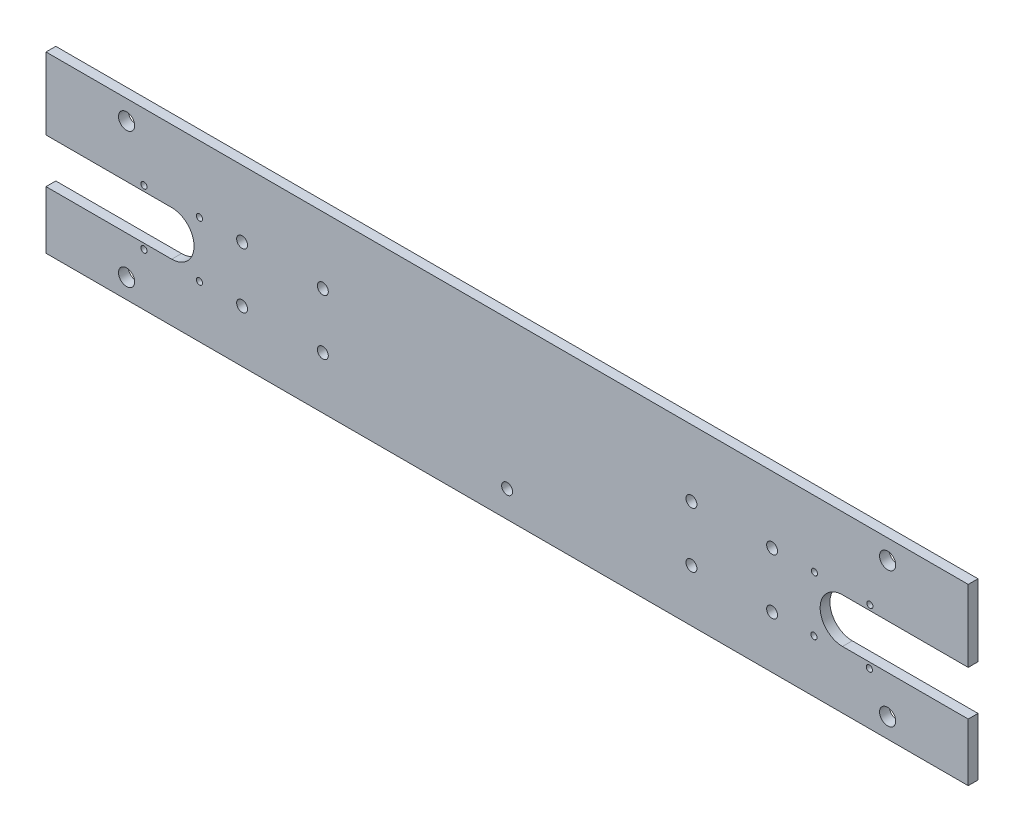
ISO-10303-21;
HEADER;
FILE_DESCRIPTION(('STEP AP214'),'2;1');
FILE_NAME('part.step','',(''),(''),'','','');
FILE_SCHEMA(('AUTOMOTIVE_DESIGN { 1 0 10303 214 1 1 1 1 }'));
ENDSEC;
DATA;
#1=APPLICATION_CONTEXT('core data for automotive mechanical design processes');
#2=APPLICATION_PROTOCOL_DEFINITION('international standard','automotive_design',2000,#1);
#3=PRODUCT_CONTEXT('',#1,'mechanical');
#4=PRODUCT('Part','Part','',(#3));
#5=PRODUCT_RELATED_PRODUCT_CATEGORY('part','',(#4));
#6=PRODUCT_DEFINITION_FORMATION('','',#4);
#7=PRODUCT_DEFINITION_CONTEXT('part definition',#1,'design');
#8=PRODUCT_DEFINITION('design','',#6,#7);
#9=PRODUCT_DEFINITION_SHAPE('','',#8);
#10=(LENGTH_UNIT() NAMED_UNIT(*) SI_UNIT(.MILLI.,.METRE.));
#11=(NAMED_UNIT(*) PLANE_ANGLE_UNIT() SI_UNIT($,.RADIAN.));
#12=(NAMED_UNIT(*) SI_UNIT($,.STERADIAN.) SOLID_ANGLE_UNIT());
#13=UNCERTAINTY_MEASURE_WITH_UNIT(LENGTH_MEASURE(1.E-05),#10,'distance_accuracy_value','');
#14=(GEOMETRIC_REPRESENTATION_CONTEXT(3) GLOBAL_UNCERTAINTY_ASSIGNED_CONTEXT((#13)) GLOBAL_UNIT_ASSIGNED_CONTEXT((#10,
#11,#12)) REPRESENTATION_CONTEXT('',''));
#15=CARTESIAN_POINT('',(0.,0.,0.));
#16=DIRECTION('',(0.,0.,1.));
#17=DIRECTION('',(1.,0.,0.));
#18=AXIS2_PLACEMENT_3D('',#15,#16,#17);
#19=CARTESIAN_POINT('',(13.0279414326682,139.511167818449,3.175));
#20=DIRECTION('',(1.,0.,0.));
#21=DIRECTION('',(0.,0.,-1.));
#22=AXIS2_PLACEMENT_3D('',#19,#20,#21);
#23=PLANE('',#22);
#24=DIRECTION('',(0.,-1.,0.));
#25=VECTOR('',#24,1.);
#26=CARTESIAN_POINT('',(13.0279414326682,139.511167818449,3.175));
#27=LINE('',#26,#25);
#28=CARTESIAN_POINT('',(13.0279414326682,101.654807818093,3.175));
#29=VERTEX_POINT('',#28);
#30=CARTESIAN_POINT('',(13.0279414326682,82.9123478184496,3.175));
#31=VERTEX_POINT('',#30);
#32=EDGE_CURVE('E319',#29,#31,#27,.T.);
#33=ORIENTED_EDGE('',*,*,#32,.F.);
#34=DIRECTION('',(0.,0.,1.));
#35=VECTOR('',#34,1.);
#36=CARTESIAN_POINT('',(13.0279414326682,101.654807818093,0.));
#37=LINE('',#36,#35);
#38=CARTESIAN_POINT('',(13.0279414326682,101.654807818093,0.));
#39=VERTEX_POINT('',#38);
#40=EDGE_CURVE('E163',#39,#29,#37,.T.);
#41=ORIENTED_EDGE('',*,*,#40,.F.);
#42=DIRECTION('',(0.,-1.,0.));
#43=VECTOR('',#42,1.);
#44=CARTESIAN_POINT('',(13.0279414326682,139.511167818449,0.));
#45=LINE('',#44,#43);
#46=CARTESIAN_POINT('',(13.0279414326682,82.9123478184496,0.));
#47=VERTEX_POINT('',#46);
#48=EDGE_CURVE('E312',#39,#47,#45,.T.);
#49=ORIENTED_EDGE('',*,*,#48,.T.);
#50=DIRECTION('',(0.,0.,-1.));
#51=VECTOR('',#50,1.);
#52=CARTESIAN_POINT('',(13.0279414326682,82.9123478184496,3.175));
#53=LINE('',#52,#51);
#54=EDGE_CURVE('E11',#31,#47,#53,.T.);
#55=ORIENTED_EDGE('',*,*,#54,.F.);
#56=EDGE_LOOP('',(#33,#41,#49,#55));
#57=FACE_BOUND('',#56,.T.);
#58=ADVANCED_FACE('F41',(#57),#23,.F.);
#59=CARTESIAN_POINT('',(312.426067450613,139.511167818449,3.175));
#60=DIRECTION('',(-1.,0.,0.));
#61=DIRECTION('',(0.,0.,1.));
#62=AXIS2_PLACEMENT_3D('',#59,#60,#61);
#63=PLANE('',#62);
#64=DIRECTION('',(0.,1.,0.));
#65=VECTOR('',#64,1.);
#66=CARTESIAN_POINT('',(312.426067450613,139.511167818449,3.175));
#67=LINE('',#66,#65);
#68=CARTESIAN_POINT('',(312.426067450613,116.163287818093,3.175));
#69=VERTEX_POINT('',#68);
#70=CARTESIAN_POINT('',(312.426067450613,139.511167818449,3.175));
#71=VERTEX_POINT('',#70);
#72=EDGE_CURVE('E321',#69,#71,#67,.T.);
#73=ORIENTED_EDGE('',*,*,#72,.F.);
#74=DIRECTION('',(0.,0.,1.));
#75=VECTOR('',#74,1.);
#76=CARTESIAN_POINT('',(312.426067450613,116.163287818093,0.));
#77=LINE('',#76,#75);
#78=CARTESIAN_POINT('',(312.426067450613,116.163287818093,0.));
#79=VERTEX_POINT('',#78);
#80=EDGE_CURVE('E184',#79,#69,#77,.T.);
#81=ORIENTED_EDGE('',*,*,#80,.F.);
#82=DIRECTION('',(0.,1.,0.));
#83=VECTOR('',#82,1.);
#84=CARTESIAN_POINT('',(312.426067450613,139.511167818449,0.));
#85=LINE('',#84,#83);
#86=CARTESIAN_POINT('',(312.426067450613,139.511167818449,0.));
#87=VERTEX_POINT('',#86);
#88=EDGE_CURVE('E332',#79,#87,#85,.T.);
#89=ORIENTED_EDGE('',*,*,#88,.T.);
#90=DIRECTION('',(0.,0.,-1.));
#91=VECTOR('',#90,1.);
#92=CARTESIAN_POINT('',(312.426067450613,139.511167818449,3.175));
#93=LINE('',#92,#91);
#94=EDGE_CURVE('E340',#71,#87,#93,.T.);
#95=ORIENTED_EDGE('',*,*,#94,.F.);
#96=EDGE_LOOP('',(#73,#81,#89,#95));
#97=FACE_BOUND('',#96,.T.);
#98=ADVANCED_FACE('F377',(#97),#63,.F.);
#99=CARTESIAN_POINT('',(0.,0.,3.175));
#100=DIRECTION('',(0.,0.,1.));
#101=DIRECTION('',(1.,0.,0.));
#102=AXIS2_PLACEMENT_3D('',#99,#100,#101);
#103=PLANE('',#102);
#104=DIRECTION('',(1.,0.,0.));
#105=VECTOR('',#104,1.);
#106=CARTESIAN_POINT('',(53.8457414326691,101.654807818093,3.175));
#107=LINE('',#106,#105);
#108=CARTESIAN_POINT('',(53.8457414326691,101.654807818093,3.175));
#109=VERTEX_POINT('',#108);
#110=EDGE_CURVE('E151',#29,#109,#107,.T.);
#111=ORIENTED_EDGE('',*,*,#110,.F.);
#112=ORIENTED_EDGE('',*,*,#32,.T.);
#113=DIRECTION('',(1.,0.,0.));
#114=VECTOR('',#113,1.);
#115=CARTESIAN_POINT('',(13.0279414326682,82.9123478184496,3.175));
#116=LINE('',#115,#114);
#117=CARTESIAN_POINT('',(312.426067450613,82.9123478184496,3.175));
#118=VERTEX_POINT('',#117);
#119=EDGE_CURVE('E318',#31,#118,#116,.T.);
#120=ORIENTED_EDGE('',*,*,#119,.T.);
#121=CARTESIAN_POINT('',(312.426067450613,101.654807818093,3.175));
#122=VERTEX_POINT('',#121);
#123=EDGE_CURVE('E322',#118,#122,#67,.T.);
#124=ORIENTED_EDGE('',*,*,#123,.T.);
#125=DIRECTION('',(1.,0.,0.));
#126=VECTOR('',#125,1.);
#127=CARTESIAN_POINT('',(271.608267450612,101.654807818093,3.175));
#128=LINE('',#127,#126);
#129=CARTESIAN_POINT('',(271.608267450612,101.654807818093,3.175));
#130=VERTEX_POINT('',#129);
#131=EDGE_CURVE('E64',#130,#122,#128,.T.);
#132=ORIENTED_EDGE('',*,*,#131,.F.);
#133=CARTESIAN_POINT('',(271.608267450612,108.909047818093,3.175));
#134=DIRECTION('',(0.,0.,1.));
#135=DIRECTION('',(-1.,0.,0.));
#136=AXIS2_PLACEMENT_3D('',#133,#134,#135);
#137=CIRCLE('',#136,7.25423999999999);
#138=CARTESIAN_POINT('',(271.608267450612,116.163287818093,3.175));
#139=VERTEX_POINT('',#138);
#140=EDGE_CURVE('E177',#139,#130,#137,.T.);
#141=ORIENTED_EDGE('',*,*,#140,.F.);
#142=DIRECTION('',(-1.,0.,0.));
#143=VECTOR('',#142,1.);
#144=CARTESIAN_POINT('',(271.608267450612,116.163287818093,3.175));
#145=LINE('',#144,#143);
#146=EDGE_CURVE('E170',#69,#139,#145,.T.);
#147=ORIENTED_EDGE('',*,*,#146,.F.);
#148=ORIENTED_EDGE('',*,*,#72,.T.);
#149=DIRECTION('',(-1.,0.,0.));
#150=VECTOR('',#149,1.);
#151=CARTESIAN_POINT('',(13.0279414326682,139.511167818449,3.175));
#152=LINE('',#151,#150);
#153=CARTESIAN_POINT('',(13.0279414326682,139.511167818449,3.175));
#154=VERTEX_POINT('',#153);
#155=EDGE_CURVE('E325',#71,#154,#152,.T.);
#156=ORIENTED_EDGE('',*,*,#155,.T.);
#157=CARTESIAN_POINT('',(13.0279414326682,116.163287818093,3.175));
#158=VERTEX_POINT('',#157);
#159=EDGE_CURVE('E315',#154,#158,#27,.T.);
#160=ORIENTED_EDGE('',*,*,#159,.T.);
#161=DIRECTION('',(-1.,0.,0.));
#162=VECTOR('',#161,1.);
#163=CARTESIAN_POINT('',(53.8457414326691,116.163287818093,3.175));
#164=LINE('',#163,#162);
#165=CARTESIAN_POINT('',(53.8457414326691,116.163287818093,3.175));
#166=VERTEX_POINT('',#165);
#167=EDGE_CURVE('E56',#166,#158,#164,.T.);
#168=ORIENTED_EDGE('',*,*,#167,.F.);
#169=CARTESIAN_POINT('',(53.8457414326691,108.909047818093,3.175));
#170=DIRECTION('',(0.,0.,1.));
#171=DIRECTION('',(1.,0.,0.));
#172=AXIS2_PLACEMENT_3D('',#169,#170,#171);
#173=CIRCLE('',#172,7.25423999999999);
#174=EDGE_CURVE('E137',#109,#166,#173,.T.);
#175=ORIENTED_EDGE('',*,*,#174,.F.);
#176=EDGE_LOOP('',(#111,#112,#120,#124,#132,#141,#147,#148,#156,#160,#168,#175));
#177=FACE_BOUND('',#176,.T.);
#178=CARTESIAN_POINT('',(248.758451386409,99.9090478180932,3.175));
#179=DIRECTION('',(0.,0.,1.));
#180=DIRECTION('',(-1.,0.,0.));
#181=AXIS2_PLACEMENT_3D('',#178,#179,#180);
#182=CIRCLE('',#181,1.77799999999998);
#183=CARTESIAN_POINT('',(246.980451386409,99.9090478180932,3.175));
#184=VERTEX_POINT('',#183);
#185=EDGE_CURVE('E204',#184,#184,#182,.T.);
#186=ORIENTED_EDGE('',*,*,#185,.F.);
#187=EDGE_LOOP('',(#186));
#188=FACE_BOUND('',#187,.T.);
#189=CARTESIAN_POINT('',(102.895189625278,99.9090478180938,3.175));
#190=DIRECTION('',(0.,0.,1.));
#191=DIRECTION('',(1.,0.,0.));
#192=AXIS2_PLACEMENT_3D('',#189,#190,#191);
#193=CIRCLE('',#192,1.778);
#194=CARTESIAN_POINT('',(104.673189625278,99.9090478180938,3.175));
#195=VERTEX_POINT('',#194);
#196=EDGE_CURVE('E217',#195,#195,#193,.T.);
#197=ORIENTED_EDGE('',*,*,#196,.F.);
#198=EDGE_LOOP('',(#197));
#199=FACE_BOUND('',#198,.T.);
#200=CARTESIAN_POINT('',(102.895189625278,117.909047818093,3.175));
#201=DIRECTION('',(0.,0.,1.));
#202=DIRECTION('',(1.,0.,0.));
#203=AXIS2_PLACEMENT_3D('',#200,#201,#202);
#204=CIRCLE('',#203,1.778);
#205=CARTESIAN_POINT('',(104.673189625278,117.909047818093,3.175));
#206=VERTEX_POINT('',#205);
#207=EDGE_CURVE('E216',#206,#206,#204,.T.);
#208=ORIENTED_EDGE('',*,*,#207,.F.);
#209=EDGE_LOOP('',(#208));
#210=FACE_BOUND('',#209,.T.);
#211=CARTESIAN_POINT('',(76.6955574968718,99.9090478180938,3.175));
#212=DIRECTION('',(0.,0.,1.));
#213=DIRECTION('',(1.,0.,0.));
#214=AXIS2_PLACEMENT_3D('',#211,#212,#213);
#215=CIRCLE('',#214,1.778);
#216=CARTESIAN_POINT('',(78.4735574968718,99.9090478180938,3.175));
#217=VERTEX_POINT('',#216);
#218=EDGE_CURVE('E229',#217,#217,#215,.T.);
#219=ORIENTED_EDGE('',*,*,#218,.F.);
#220=EDGE_LOOP('',(#219));
#221=FACE_BOUND('',#220,.T.);
#222=CARTESIAN_POINT('',(162.727004441641,91.5637545544701,3.175));
#223=DIRECTION('',(0.,0.,1.));
#224=DIRECTION('',(-1.,0.,0.));
#225=AXIS2_PLACEMENT_3D('',#222,#223,#224);
#226=CIRCLE('',#225,1.778);
#227=CARTESIAN_POINT('',(160.949004441641,91.5637545544701,3.175));
#228=VERTEX_POINT('',#227);
#229=EDGE_CURVE('E162',#228,#228,#226,.T.);
#230=ORIENTED_EDGE('',*,*,#229,.F.);
#231=EDGE_LOOP('',(#230));
#232=FACE_BOUND('',#231,.T.);
#233=CARTESIAN_POINT('',(248.758451386409,117.909047818092,3.175));
#234=DIRECTION('',(0.,0.,1.));
#235=DIRECTION('',(-1.,0.,0.));
#236=AXIS2_PLACEMENT_3D('',#233,#234,#235);
#237=CIRCLE('',#236,1.77799999999995);
#238=CARTESIAN_POINT('',(246.980451386409,117.909047818092,3.175));
#239=VERTEX_POINT('',#238);
#240=EDGE_CURVE('E193',#239,#239,#237,.T.);
#241=ORIENTED_EDGE('',*,*,#240,.F.);
#242=EDGE_LOOP('',(#241));
#243=FACE_BOUND('',#242,.T.);
#244=CARTESIAN_POINT('',(222.558819258003,117.909047818093,3.175));
#245=DIRECTION('',(0.,0.,1.));
#246=DIRECTION('',(-1.,0.,0.));
#247=AXIS2_PLACEMENT_3D('',#244,#245,#246);
#248=CIRCLE('',#247,1.778);
#249=CARTESIAN_POINT('',(220.780819258003,117.909047818093,3.175));
#250=VERTEX_POINT('',#249);
#251=EDGE_CURVE('E192',#250,#250,#248,.T.);
#252=ORIENTED_EDGE('',*,*,#251,.F.);
#253=EDGE_LOOP('',(#252));
#254=FACE_BOUND('',#253,.T.);
#255=CARTESIAN_POINT('',(222.558819258003,99.9090478180934,3.175));
#256=DIRECTION('',(0.,0.,1.));
#257=DIRECTION('',(-1.,0.,0.));
#258=AXIS2_PLACEMENT_3D('',#255,#256,#257);
#259=CIRCLE('',#258,1.778);
#260=CARTESIAN_POINT('',(220.780819258003,99.9090478180934,3.175));
#261=VERTEX_POINT('',#260);
#262=EDGE_CURVE('E205',#261,#261,#259,.T.);
#263=ORIENTED_EDGE('',*,*,#262,.F.);
#264=EDGE_LOOP('',(#263));
#265=FACE_BOUND('',#264,.T.);
#266=CARTESIAN_POINT('',(76.6955574968717,117.909047818093,3.175));
#267=DIRECTION('',(0.,0.,1.));
#268=DIRECTION('',(1.,0.,0.));
#269=AXIS2_PLACEMENT_3D('',#266,#267,#268);
#270=CIRCLE('',#269,1.778);
#271=CARTESIAN_POINT('',(78.4735574968717,117.909047818093,3.175));
#272=VERTEX_POINT('',#271);
#273=EDGE_CURVE('E228',#272,#272,#270,.T.);
#274=ORIENTED_EDGE('',*,*,#273,.F.);
#275=EDGE_LOOP('',(#274));
#276=FACE_BOUND('',#275,.T.);
#277=CARTESIAN_POINT('',(62.8457414326686,117.909047818093,3.175));
#278=DIRECTION('',(0.,0.,1.));
#279=DIRECTION('',(1.,0.,0.));
#280=AXIS2_PLACEMENT_3D('',#277,#278,#279);
#281=CIRCLE('',#280,0.999999999999985);
#282=CARTESIAN_POINT('',(63.8457414326686,117.909047818093,3.175));
#283=VERTEX_POINT('',#282);
#284=EDGE_CURVE('E252',#283,#283,#281,.T.);
#285=ORIENTED_EDGE('',*,*,#284,.F.);
#286=EDGE_LOOP('',(#285));
#287=FACE_BOUND('',#286,.T.);
#288=CARTESIAN_POINT('',(262.336126105717,99.9939547590878,3.175));
#289=DIRECTION('',(0.,0.,1.));
#290=DIRECTION('',(1.,0.,0.));
#291=AXIS2_PLACEMENT_3D('',#288,#289,#290);
#292=CIRCLE('',#291,0.999999999999998);
#293=CARTESIAN_POINT('',(263.336126105717,99.9939547590878,3.175));
#294=VERTEX_POINT('',#293);
#295=EDGE_CURVE('E265',#294,#294,#292,.T.);
#296=ORIENTED_EDGE('',*,*,#295,.F.);
#297=EDGE_LOOP('',(#296));
#298=FACE_BOUND('',#297,.T.);
#299=CARTESIAN_POINT('',(262.504948479307,117.993163047403,3.175));
#300=DIRECTION('',(0.,0.,1.));
#301=DIRECTION('',(1.,0.,0.));
#302=AXIS2_PLACEMENT_3D('',#299,#300,#301);
#303=CIRCLE('',#302,0.999999999999998);
#304=CARTESIAN_POINT('',(263.504948479307,117.993163047403,3.175));
#305=VERTEX_POINT('',#304);
#306=EDGE_CURVE('E264',#305,#305,#303,.T.);
#307=ORIENTED_EDGE('',*,*,#306,.F.);
#308=EDGE_LOOP('',(#307));
#309=FACE_BOUND('',#308,.T.);
#310=CARTESIAN_POINT('',(280.335334394032,99.825132385498,3.175));
#311=DIRECTION('',(0.,0.,1.));
#312=DIRECTION('',(1.,0.,0.));
#313=AXIS2_PLACEMENT_3D('',#310,#311,#312);
#314=CIRCLE('',#313,0.999999999999998);
#315=CARTESIAN_POINT('',(281.335334394032,99.825132385498,3.175));
#316=VERTEX_POINT('',#315);
#317=EDGE_CURVE('E277',#316,#316,#314,.T.);
#318=ORIENTED_EDGE('',*,*,#317,.F.);
#319=EDGE_LOOP('',(#318));
#320=FACE_BOUND('',#319,.T.);
#321=CARTESIAN_POINT('',(44.8457414326697,99.9090478180936,3.175));
#322=DIRECTION('',(0.,0.,1.));
#323=DIRECTION('',(1.,0.,0.));
#324=AXIS2_PLACEMENT_3D('',#321,#322,#323);
#325=CIRCLE('',#324,0.999999999999985);
#326=CARTESIAN_POINT('',(45.8457414326696,99.9090478180936,3.175));
#327=VERTEX_POINT('',#326);
#328=EDGE_CURVE('E240',#327,#327,#325,.T.);
#329=ORIENTED_EDGE('',*,*,#328,.F.);
#330=EDGE_LOOP('',(#329));
#331=FACE_BOUND('',#330,.T.);
#332=CARTESIAN_POINT('',(44.8457414326695,117.909047818093,3.175));
#333=DIRECTION('',(0.,0.,1.));
#334=DIRECTION('',(1.,0.,0.));
#335=AXIS2_PLACEMENT_3D('',#332,#333,#334);
#336=CIRCLE('',#335,0.999999999999985);
#337=CARTESIAN_POINT('',(45.8457414326694,117.909047818093,3.175));
#338=VERTEX_POINT('',#337);
#339=EDGE_CURVE('E246',#338,#338,#336,.T.);
#340=ORIENTED_EDGE('',*,*,#339,.F.);
#341=EDGE_LOOP('',(#340));
#342=FACE_BOUND('',#341,.T.);
#343=CARTESIAN_POINT('',(62.8457414326688,99.9090478180938,3.175));
#344=DIRECTION('',(0.,0.,1.));
#345=DIRECTION('',(1.,0.,0.));
#346=AXIS2_PLACEMENT_3D('',#343,#344,#345);
#347=CIRCLE('',#346,0.999999999999985);
#348=CARTESIAN_POINT('',(63.8457414326688,99.9090478180938,3.175));
#349=VERTEX_POINT('',#348);
#350=EDGE_CURVE('E253',#349,#349,#347,.T.);
#351=ORIENTED_EDGE('',*,*,#350,.F.);
#352=EDGE_LOOP('',(#351));
#353=FACE_BOUND('',#352,.T.);
#354=CARTESIAN_POINT('',(280.504156767622,117.824340673813,3.175));
#355=DIRECTION('',(0.,0.,1.));
#356=DIRECTION('',(1.,0.,0.));
#357=AXIS2_PLACEMENT_3D('',#354,#355,#356);
#358=CIRCLE('',#357,0.999999999999998);
#359=CARTESIAN_POINT('',(281.504156767622,117.824340673813,3.175));
#360=VERTEX_POINT('',#359);
#361=EDGE_CURVE('E276',#360,#360,#358,.T.);
#362=ORIENTED_EDGE('',*,*,#361,.F.);
#363=EDGE_LOOP('',(#362));
#364=FACE_BOUND('',#363,.T.);
#365=CARTESIAN_POINT('',(39.1874014326683,133.161167818449,3.175));
#366=DIRECTION('',(0.,0.,1.));
#367=DIRECTION('',(1.,0.,0.));
#368=AXIS2_PLACEMENT_3D('',#365,#366,#367);
#369=CIRCLE('',#368,2.62500000000002);
#370=CARTESIAN_POINT('',(41.8124014326683,133.161167818449,3.175));
#371=VERTEX_POINT('',#370);
#372=EDGE_CURVE('E297',#371,#371,#369,.T.);
#373=ORIENTED_EDGE('',*,*,#372,.F.);
#374=EDGE_LOOP('',(#373));
#375=FACE_BOUND('',#374,.T.);
#376=CARTESIAN_POINT('',(286.266607450613,133.16116781845,3.175));
#377=DIRECTION('',(0.,0.,1.));
#378=DIRECTION('',(1.,0.,0.));
#379=AXIS2_PLACEMENT_3D('',#376,#377,#378);
#380=CIRCLE('',#379,2.62499999999998);
#381=CARTESIAN_POINT('',(288.891607450613,133.16116781845,3.175));
#382=VERTEX_POINT('',#381);
#383=EDGE_CURVE('E309',#382,#382,#380,.T.);
#384=ORIENTED_EDGE('',*,*,#383,.F.);
#385=EDGE_LOOP('',(#384));
#386=FACE_BOUND('',#385,.T.);
#387=CARTESIAN_POINT('',(286.266607450613,89.2623478184496,3.175));
#388=DIRECTION('',(0.,0.,1.));
#389=DIRECTION('',(1.,0.,0.));
#390=AXIS2_PLACEMENT_3D('',#387,#388,#389);
#391=CIRCLE('',#390,2.62499999999997);
#392=CARTESIAN_POINT('',(288.891607450613,89.2623478184496,3.175));
#393=VERTEX_POINT('',#392);
#394=EDGE_CURVE('E303',#393,#393,#391,.T.);
#395=ORIENTED_EDGE('',*,*,#394,.F.);
#396=EDGE_LOOP('',(#395));
#397=FACE_BOUND('',#396,.T.);
#398=CARTESIAN_POINT('',(39.1874014326687,89.262347818449,3.175));
#399=DIRECTION('',(0.,0.,1.));
#400=DIRECTION('',(1.,0.,0.));
#401=AXIS2_PLACEMENT_3D('',#398,#399,#400);
#402=CIRCLE('',#401,2.625);
#403=CARTESIAN_POINT('',(41.8124014326687,89.262347818449,3.175));
#404=VERTEX_POINT('',#403);
#405=EDGE_CURVE('E291',#404,#404,#402,.T.);
#406=ORIENTED_EDGE('',*,*,#405,.F.);
#407=EDGE_LOOP('',(#406));
#408=FACE_BOUND('',#407,.T.);
#409=ADVANCED_FACE('F356',(#177,#188,#199,#210,#221,#232,#243,#254,#265,#276,#287,#298,#309,
#320,#331,#342,#353,#364,#375,#386,#397,#408),#103,.T.);
#410=CARTESIAN_POINT('',(0.,0.,0.));
#411=DIRECTION('',(0.,0.,1.));
#412=DIRECTION('',(1.,0.,0.));
#413=AXIS2_PLACEMENT_3D('',#410,#411,#412);
#414=PLANE('',#413);
#415=CARTESIAN_POINT('',(248.758451386409,99.9090478180932,0.));
#416=DIRECTION('',(0.,0.,1.));
#417=DIRECTION('',(-1.,0.,0.));
#418=AXIS2_PLACEMENT_3D('',#415,#416,#417);
#419=CIRCLE('',#418,1.77799999999998);
#420=CARTESIAN_POINT('',(246.980451386409,99.9090478180932,0.));
#421=VERTEX_POINT('',#420);
#422=EDGE_CURVE('E220',#421,#421,#419,.T.);
#423=ORIENTED_EDGE('',*,*,#422,.T.);
#424=EDGE_LOOP('',(#423));
#425=FACE_BOUND('',#424,.T.);
#426=CARTESIAN_POINT('',(102.895189625278,99.9090478180938,0.));
#427=DIRECTION('',(0.,0.,1.));
#428=DIRECTION('',(1.,0.,0.));
#429=AXIS2_PLACEMENT_3D('',#426,#427,#428);
#430=CIRCLE('',#429,1.778);
#431=CARTESIAN_POINT('',(104.673189625278,99.9090478180938,0.));
#432=VERTEX_POINT('',#431);
#433=EDGE_CURVE('E213',#432,#432,#430,.T.);
#434=ORIENTED_EDGE('',*,*,#433,.T.);
#435=EDGE_LOOP('',(#434));
#436=FACE_BOUND('',#435,.T.);
#437=CARTESIAN_POINT('',(102.895189625278,117.909047818093,0.));
#438=DIRECTION('',(0.,0.,1.));
#439=DIRECTION('',(1.,0.,0.));
#440=AXIS2_PLACEMENT_3D('',#437,#438,#439);
#441=CIRCLE('',#440,1.778);
#442=CARTESIAN_POINT('',(104.673189625278,117.909047818093,0.));
#443=VERTEX_POINT('',#442);
#444=EDGE_CURVE('E232',#443,#443,#441,.T.);
#445=ORIENTED_EDGE('',*,*,#444,.T.);
#446=EDGE_LOOP('',(#445));
#447=FACE_BOUND('',#446,.T.);
#448=CARTESIAN_POINT('',(76.6955574968718,99.9090478180938,0.));
#449=DIRECTION('',(0.,0.,1.));
#450=DIRECTION('',(1.,0.,0.));
#451=AXIS2_PLACEMENT_3D('',#448,#449,#450);
#452=CIRCLE('',#451,1.778);
#453=CARTESIAN_POINT('',(78.4735574968718,99.9090478180938,0.));
#454=VERTEX_POINT('',#453);
#455=EDGE_CURVE('E225',#454,#454,#452,.T.);
#456=ORIENTED_EDGE('',*,*,#455,.T.);
#457=EDGE_LOOP('',(#456));
#458=FACE_BOUND('',#457,.T.);
#459=CARTESIAN_POINT('',(162.727004441641,91.5637545544701,0.));
#460=DIRECTION('',(0.,0.,1.));
#461=DIRECTION('',(-1.,0.,0.));
#462=AXIS2_PLACEMENT_3D('',#459,#460,#461);
#463=CIRCLE('',#462,1.778);
#464=CARTESIAN_POINT('',(160.949004441641,91.5637545544701,0.));
#465=VERTEX_POINT('',#464);
#466=EDGE_CURVE('E196',#465,#465,#463,.T.);
#467=ORIENTED_EDGE('',*,*,#466,.T.);
#468=EDGE_LOOP('',(#467));
#469=FACE_BOUND('',#468,.T.);
#470=CARTESIAN_POINT('',(248.758451386409,117.909047818092,0.));
#471=DIRECTION('',(0.,0.,1.));
#472=DIRECTION('',(-1.,0.,0.));
#473=AXIS2_PLACEMENT_3D('',#470,#471,#472);
#474=CIRCLE('',#473,1.77799999999995);
#475=CARTESIAN_POINT('',(246.980451386409,117.909047818092,0.));
#476=VERTEX_POINT('',#475);
#477=EDGE_CURVE('E189',#476,#476,#474,.T.);
#478=ORIENTED_EDGE('',*,*,#477,.T.);
#479=EDGE_LOOP('',(#478));
#480=FACE_BOUND('',#479,.T.);
#481=CARTESIAN_POINT('',(222.558819258003,117.909047818093,0.));
#482=DIRECTION('',(0.,0.,1.));
#483=DIRECTION('',(-1.,0.,0.));
#484=AXIS2_PLACEMENT_3D('',#481,#482,#483);
#485=CIRCLE('',#484,1.778);
#486=CARTESIAN_POINT('',(220.780819258003,117.909047818093,0.));
#487=VERTEX_POINT('',#486);
#488=EDGE_CURVE('E208',#487,#487,#485,.T.);
#489=ORIENTED_EDGE('',*,*,#488,.T.);
#490=EDGE_LOOP('',(#489));
#491=FACE_BOUND('',#490,.T.);
#492=CARTESIAN_POINT('',(222.558819258003,99.9090478180934,0.));
#493=DIRECTION('',(0.,0.,1.));
#494=DIRECTION('',(-1.,0.,0.));
#495=AXIS2_PLACEMENT_3D('',#492,#493,#494);
#496=CIRCLE('',#495,1.778);
#497=CARTESIAN_POINT('',(220.780819258003,99.9090478180934,0.));
#498=VERTEX_POINT('',#497);
#499=EDGE_CURVE('E201',#498,#498,#496,.T.);
#500=ORIENTED_EDGE('',*,*,#499,.T.);
#501=EDGE_LOOP('',(#500));
#502=FACE_BOUND('',#501,.T.);
#503=CARTESIAN_POINT('',(76.6955574968717,117.909047818093,0.));
#504=DIRECTION('',(0.,0.,1.));
#505=DIRECTION('',(1.,0.,0.));
#506=AXIS2_PLACEMENT_3D('',#503,#504,#505);
#507=CIRCLE('',#506,1.778);
#508=CARTESIAN_POINT('',(78.4735574968717,117.909047818093,0.));
#509=VERTEX_POINT('',#508);
#510=EDGE_CURVE('E237',#509,#509,#507,.T.);
#511=ORIENTED_EDGE('',*,*,#510,.T.);
#512=EDGE_LOOP('',(#511));
#513=FACE_BOUND('',#512,.T.);
#514=CARTESIAN_POINT('',(62.8457414326686,117.909047818093,0.));
#515=DIRECTION('',(0.,0.,1.));
#516=DIRECTION('',(1.,0.,0.));
#517=AXIS2_PLACEMENT_3D('',#514,#515,#516);
#518=CIRCLE('',#517,0.999999999999985);
#519=CARTESIAN_POINT('',(63.8457414326686,117.909047818093,0.));
#520=VERTEX_POINT('',#519);
#521=EDGE_CURVE('E268',#520,#520,#518,.T.);
#522=ORIENTED_EDGE('',*,*,#521,.T.);
#523=EDGE_LOOP('',(#522));
#524=FACE_BOUND('',#523,.T.);
#525=CARTESIAN_POINT('',(262.336126105717,99.9939547590878,0.));
#526=DIRECTION('',(0.,0.,1.));
#527=DIRECTION('',(1.,0.,0.));
#528=AXIS2_PLACEMENT_3D('',#525,#526,#527);
#529=CIRCLE('',#528,0.999999999999998);
#530=CARTESIAN_POINT('',(263.336126105717,99.9939547590878,0.));
#531=VERTEX_POINT('',#530);
#532=EDGE_CURVE('E261',#531,#531,#529,.T.);
#533=ORIENTED_EDGE('',*,*,#532,.T.);
#534=EDGE_LOOP('',(#533));
#535=FACE_BOUND('',#534,.T.);
#536=CARTESIAN_POINT('',(262.504948479307,117.993163047403,0.));
#537=DIRECTION('',(0.,0.,1.));
#538=DIRECTION('',(1.,0.,0.));
#539=AXIS2_PLACEMENT_3D('',#536,#537,#538);
#540=CIRCLE('',#539,0.999999999999998);
#541=CARTESIAN_POINT('',(263.504948479307,117.993163047403,0.));
#542=VERTEX_POINT('',#541);
#543=EDGE_CURVE('E280',#542,#542,#540,.T.);
#544=ORIENTED_EDGE('',*,*,#543,.T.);
#545=EDGE_LOOP('',(#544));
#546=FACE_BOUND('',#545,.T.);
#547=CARTESIAN_POINT('',(280.335334394032,99.825132385498,0.));
#548=DIRECTION('',(0.,0.,1.));
#549=DIRECTION('',(1.,0.,0.));
#550=AXIS2_PLACEMENT_3D('',#547,#548,#549);
#551=CIRCLE('',#550,0.999999999999998);
#552=CARTESIAN_POINT('',(281.335334394032,99.825132385498,0.));
#553=VERTEX_POINT('',#552);
#554=EDGE_CURVE('E273',#553,#553,#551,.T.);
#555=ORIENTED_EDGE('',*,*,#554,.T.);
#556=EDGE_LOOP('',(#555));
#557=FACE_BOUND('',#556,.T.);
#558=CARTESIAN_POINT('',(44.8457414326697,99.9090478180936,0.));
#559=DIRECTION('',(0.,0.,1.));
#560=DIRECTION('',(1.,0.,0.));
#561=AXIS2_PLACEMENT_3D('',#558,#559,#560);
#562=CIRCLE('',#561,0.999999999999985);
#563=CARTESIAN_POINT('',(45.8457414326696,99.9090478180936,0.));
#564=VERTEX_POINT('',#563);
#565=EDGE_CURVE('E243',#564,#564,#562,.T.);
#566=ORIENTED_EDGE('',*,*,#565,.T.);
#567=EDGE_LOOP('',(#566));
#568=FACE_BOUND('',#567,.T.);
#569=CARTESIAN_POINT('',(44.8457414326695,117.909047818093,0.));
#570=DIRECTION('',(0.,0.,1.));
#571=DIRECTION('',(1.,0.,0.));
#572=AXIS2_PLACEMENT_3D('',#569,#570,#571);
#573=CIRCLE('',#572,0.999999999999985);
#574=CARTESIAN_POINT('',(45.8457414326694,117.909047818093,0.));
#575=VERTEX_POINT('',#574);
#576=EDGE_CURVE('E256',#575,#575,#573,.T.);
#577=ORIENTED_EDGE('',*,*,#576,.T.);
#578=EDGE_LOOP('',(#577));
#579=FACE_BOUND('',#578,.T.);
#580=CARTESIAN_POINT('',(62.8457414326688,99.9090478180938,0.));
#581=DIRECTION('',(0.,0.,1.));
#582=DIRECTION('',(1.,0.,0.));
#583=AXIS2_PLACEMENT_3D('',#580,#581,#582);
#584=CIRCLE('',#583,0.999999999999985);
#585=CARTESIAN_POINT('',(63.8457414326688,99.9090478180938,0.));
#586=VERTEX_POINT('',#585);
#587=EDGE_CURVE('E249',#586,#586,#584,.T.);
#588=ORIENTED_EDGE('',*,*,#587,.T.);
#589=EDGE_LOOP('',(#588));
#590=FACE_BOUND('',#589,.T.);
#591=CARTESIAN_POINT('',(280.504156767622,117.824340673813,0.));
#592=DIRECTION('',(0.,0.,1.));
#593=DIRECTION('',(1.,0.,0.));
#594=AXIS2_PLACEMENT_3D('',#591,#592,#593);
#595=CIRCLE('',#594,0.999999999999998);
#596=CARTESIAN_POINT('',(281.504156767622,117.824340673813,0.));
#597=VERTEX_POINT('',#596);
#598=EDGE_CURVE('E285',#597,#597,#595,.T.);
#599=ORIENTED_EDGE('',*,*,#598,.T.);
#600=EDGE_LOOP('',(#599));
#601=FACE_BOUND('',#600,.T.);
#602=ORIENTED_EDGE('',*,*,#48,.F.);
#603=DIRECTION('',(1.,0.,0.));
#604=VECTOR('',#603,1.);
#605=CARTESIAN_POINT('',(53.8457414326691,101.654807818093,0.));
#606=LINE('',#605,#604);
#607=CARTESIAN_POINT('',(53.8457414326691,101.654807818093,0.));
#608=VERTEX_POINT('',#607);
#609=EDGE_CURVE('E139',#39,#608,#606,.T.);
#610=ORIENTED_EDGE('',*,*,#609,.T.);
#611=CARTESIAN_POINT('',(53.8457414326691,108.909047818093,0.));
#612=DIRECTION('',(0.,0.,1.));
#613=DIRECTION('',(1.,0.,0.));
#614=AXIS2_PLACEMENT_3D('',#611,#612,#613);
#615=CIRCLE('',#614,7.25423999999999);
#616=CARTESIAN_POINT('',(53.8457414326691,116.163287818093,0.));
#617=VERTEX_POINT('',#616);
#618=EDGE_CURVE('E134',#608,#617,#615,.T.);
#619=ORIENTED_EDGE('',*,*,#618,.T.);
#620=DIRECTION('',(-1.,0.,0.));
#621=VECTOR('',#620,1.);
#622=CARTESIAN_POINT('',(53.8457414326691,116.163287818093,0.));
#623=LINE('',#622,#621);
#624=CARTESIAN_POINT('',(13.0279414326682,116.163287818093,0.));
#625=VERTEX_POINT('',#624);
#626=EDGE_CURVE('E142',#617,#625,#623,.T.);
#627=ORIENTED_EDGE('',*,*,#626,.T.);
#628=CARTESIAN_POINT('',(13.0279414326682,139.511167818449,0.));
#629=VERTEX_POINT('',#628);
#630=EDGE_CURVE('E328',#629,#625,#45,.T.);
#631=ORIENTED_EDGE('',*,*,#630,.F.);
#632=DIRECTION('',(-1.,0.,0.));
#633=VECTOR('',#632,1.);
#634=CARTESIAN_POINT('',(13.0279414326682,139.511167818449,0.));
#635=LINE('',#634,#633);
#636=EDGE_CURVE('E336',#87,#629,#635,.T.);
#637=ORIENTED_EDGE('',*,*,#636,.F.);
#638=ORIENTED_EDGE('',*,*,#88,.F.);
#639=DIRECTION('',(-1.,0.,0.));
#640=VECTOR('',#639,1.);
#641=CARTESIAN_POINT('',(271.608267450612,116.163287818093,0.));
#642=LINE('',#641,#640);
#643=CARTESIAN_POINT('',(271.608267450612,116.163287818093,0.));
#644=VERTEX_POINT('',#643);
#645=EDGE_CURVE('E173',#79,#644,#642,.T.);
#646=ORIENTED_EDGE('',*,*,#645,.T.);
#647=CARTESIAN_POINT('',(271.608267450612,108.909047818093,0.));
#648=DIRECTION('',(0.,0.,1.));
#649=DIRECTION('',(-1.,0.,0.));
#650=AXIS2_PLACEMENT_3D('',#647,#648,#649);
#651=CIRCLE('',#650,7.25423999999999);
#652=CARTESIAN_POINT('',(271.608267450612,101.654807818093,0.));
#653=VERTEX_POINT('',#652);
#654=EDGE_CURVE('E166',#644,#653,#651,.T.);
#655=ORIENTED_EDGE('',*,*,#654,.T.);
#656=DIRECTION('',(1.,0.,0.));
#657=VECTOR('',#656,1.);
#658=CARTESIAN_POINT('',(271.608267450612,101.654807818093,0.));
#659=LINE('',#658,#657);
#660=CARTESIAN_POINT('',(312.426067450613,101.654807818093,0.));
#661=VERTEX_POINT('',#660);
#662=EDGE_CURVE('E169',#653,#661,#659,.T.);
#663=ORIENTED_EDGE('',*,*,#662,.T.);
#664=CARTESIAN_POINT('',(312.426067450613,82.9123478184496,0.));
#665=VERTEX_POINT('',#664);
#666=EDGE_CURVE('E333',#665,#661,#85,.T.);
#667=ORIENTED_EDGE('',*,*,#666,.F.);
#668=DIRECTION('',(1.,0.,0.));
#669=VECTOR('',#668,1.);
#670=CARTESIAN_POINT('',(13.0279414326682,82.9123478184496,0.));
#671=LINE('',#670,#669);
#672=EDGE_CURVE('E330',#47,#665,#671,.T.);
#673=ORIENTED_EDGE('',*,*,#672,.F.);
#674=EDGE_LOOP('',(#602,#610,#619,#627,#631,#637,#638,#646,#655,#663,#667,#673));
#675=FACE_BOUND('',#674,.T.);
#676=CARTESIAN_POINT('',(286.266607450613,133.16116781845,0.));
#677=DIRECTION('',(0.,0.,1.));
#678=DIRECTION('',(1.,0.,0.));
#679=AXIS2_PLACEMENT_3D('',#676,#677,#678);
#680=CIRCLE('',#679,2.62499999999998);
#681=CARTESIAN_POINT('',(288.891607450613,133.16116781845,0.));
#682=VERTEX_POINT('',#681);
#683=EDGE_CURVE('E306',#682,#682,#680,.T.);
#684=ORIENTED_EDGE('',*,*,#683,.T.);
#685=EDGE_LOOP('',(#684));
#686=FACE_BOUND('',#685,.T.);
#687=CARTESIAN_POINT('',(286.266607450613,89.2623478184496,0.));
#688=DIRECTION('',(0.,0.,1.));
#689=DIRECTION('',(1.,0.,0.));
#690=AXIS2_PLACEMENT_3D('',#687,#688,#689);
#691=CIRCLE('',#690,2.62499999999997);
#692=CARTESIAN_POINT('',(288.891607450613,89.2623478184496,0.));
#693=VERTEX_POINT('',#692);
#694=EDGE_CURVE('E300',#693,#693,#691,.T.);
#695=ORIENTED_EDGE('',*,*,#694,.T.);
#696=EDGE_LOOP('',(#695));
#697=FACE_BOUND('',#696,.T.);
#698=CARTESIAN_POINT('',(39.1874014326683,133.161167818449,0.));
#699=DIRECTION('',(0.,0.,1.));
#700=DIRECTION('',(1.,0.,0.));
#701=AXIS2_PLACEMENT_3D('',#698,#699,#700);
#702=CIRCLE('',#701,2.62500000000002);
#703=CARTESIAN_POINT('',(41.8124014326683,133.161167818449,0.));
#704=VERTEX_POINT('',#703);
#705=EDGE_CURVE('E294',#704,#704,#702,.T.);
#706=ORIENTED_EDGE('',*,*,#705,.T.);
#707=EDGE_LOOP('',(#706));
#708=FACE_BOUND('',#707,.T.);
#709=CARTESIAN_POINT('',(39.1874014326687,89.262347818449,0.));
#710=DIRECTION('',(0.,0.,1.));
#711=DIRECTION('',(1.,0.,0.));
#712=AXIS2_PLACEMENT_3D('',#709,#710,#711);
#713=CIRCLE('',#712,2.625);
#714=CARTESIAN_POINT('',(41.8124014326687,89.262347818449,0.));
#715=VERTEX_POINT('',#714);
#716=EDGE_CURVE('E288',#715,#715,#713,.T.);
#717=ORIENTED_EDGE('',*,*,#716,.T.);
#718=EDGE_LOOP('',(#717));
#719=FACE_BOUND('',#718,.T.);
#720=ADVANCED_FACE('F149',(#425,#436,#447,#458,#469,#480,#491,#502,#513,#524,#535,#546,#557,
#568,#579,#590,#601,#675,#686,#697,#708,#719),#414,.F.);
#721=ORIENTED_EDGE('',*,*,#630,.T.);
#722=DIRECTION('',(0.,0.,1.));
#723=VECTOR('',#722,1.);
#724=CARTESIAN_POINT('',(13.0279414326682,116.163287818093,0.));
#725=LINE('',#724,#723);
#726=EDGE_CURVE('E138',#625,#158,#725,.T.);
#727=ORIENTED_EDGE('',*,*,#726,.T.);
#728=ORIENTED_EDGE('',*,*,#159,.F.);
#729=DIRECTION('',(0.,0.,-1.));
#730=VECTOR('',#729,1.);
#731=CARTESIAN_POINT('',(13.0279414326682,139.511167818449,3.175));
#732=LINE('',#731,#730);
#733=EDGE_CURVE('E327',#154,#629,#732,.T.);
#734=ORIENTED_EDGE('',*,*,#733,.T.);
#735=EDGE_LOOP('',(#721,#727,#728,#734));
#736=FACE_BOUND('',#735,.T.);
#737=ADVANCED_FACE('F43',(#736),#23,.F.);
#738=CARTESIAN_POINT('',(13.0279414326682,82.9123478184496,3.175));
#739=DIRECTION('',(0.,1.,0.));
#740=DIRECTION('',(0.,0.,1.));
#741=AXIS2_PLACEMENT_3D('',#738,#739,#740);
#742=PLANE('',#741);
#743=ORIENTED_EDGE('',*,*,#672,.T.);
#744=DIRECTION('',(0.,0.,-1.));
#745=VECTOR('',#744,1.);
#746=CARTESIAN_POINT('',(312.426067450613,82.9123478184496,3.175));
#747=LINE('',#746,#745);
#748=EDGE_CURVE('E49',#118,#665,#747,.T.);
#749=ORIENTED_EDGE('',*,*,#748,.F.);
#750=ORIENTED_EDGE('',*,*,#119,.F.);
#751=ORIENTED_EDGE('',*,*,#54,.T.);
#752=EDGE_LOOP('',(#743,#749,#750,#751));
#753=FACE_BOUND('',#752,.T.);
#754=ADVANCED_FACE('F361',(#753),#742,.F.);
#755=ORIENTED_EDGE('',*,*,#666,.T.);
#756=DIRECTION('',(0.,0.,1.));
#757=VECTOR('',#756,1.);
#758=CARTESIAN_POINT('',(312.426067450613,101.654807818093,0.));
#759=LINE('',#758,#757);
#760=EDGE_CURVE('E186',#661,#122,#759,.T.);
#761=ORIENTED_EDGE('',*,*,#760,.T.);
#762=ORIENTED_EDGE('',*,*,#123,.F.);
#763=ORIENTED_EDGE('',*,*,#748,.T.);
#764=EDGE_LOOP('',(#755,#761,#762,#763));
#765=FACE_BOUND('',#764,.T.);
#766=ADVANCED_FACE('F347',(#765),#63,.F.);
#767=CARTESIAN_POINT('',(13.0279414326682,139.511167818449,3.175));
#768=DIRECTION('',(0.,-1.,0.));
#769=DIRECTION('',(0.,0.,-1.));
#770=AXIS2_PLACEMENT_3D('',#767,#768,#769);
#771=PLANE('',#770);
#772=ORIENTED_EDGE('',*,*,#636,.T.);
#773=ORIENTED_EDGE('',*,*,#733,.F.);
#774=ORIENTED_EDGE('',*,*,#155,.F.);
#775=ORIENTED_EDGE('',*,*,#94,.T.);
#776=EDGE_LOOP('',(#772,#773,#774,#775));
#777=FACE_BOUND('',#776,.T.);
#778=ADVANCED_FACE('F373',(#777),#771,.F.);
#779=CARTESIAN_POINT('',(286.266607450613,133.16116781845,3.175));
#780=DIRECTION('',(0.,0.,-1.));
#781=DIRECTION('',(-1.,0.,0.));
#782=AXIS2_PLACEMENT_3D('',#779,#780,#781);
#783=CYLINDRICAL_SURFACE('',#782,2.62499999999998);
#784=ORIENTED_EDGE('',*,*,#383,.T.);
#785=EDGE_LOOP('',(#784));
#786=FACE_BOUND('',#785,.T.);
#787=ORIENTED_EDGE('',*,*,#683,.F.);
#788=EDGE_LOOP('',(#787));
#789=FACE_BOUND('',#788,.T.);
#790=ADVANCED_FACE('F419',(#786,#789),#783,.F.);
#791=CARTESIAN_POINT('',(286.266607450613,89.2623478184496,3.175));
#792=DIRECTION('',(0.,0.,-1.));
#793=DIRECTION('',(-1.,0.,0.));
#794=AXIS2_PLACEMENT_3D('',#791,#792,#793);
#795=CYLINDRICAL_SURFACE('',#794,2.62499999999997);
#796=ORIENTED_EDGE('',*,*,#394,.T.);
#797=EDGE_LOOP('',(#796));
#798=FACE_BOUND('',#797,.T.);
#799=ORIENTED_EDGE('',*,*,#694,.F.);
#800=EDGE_LOOP('',(#799));
#801=FACE_BOUND('',#800,.T.);
#802=ADVANCED_FACE('F637',(#798,#801),#795,.F.);
#803=CARTESIAN_POINT('',(39.1874014326683,133.161167818449,3.175));
#804=DIRECTION('',(0.,0.,-1.));
#805=DIRECTION('',(-1.,0.,0.));
#806=AXIS2_PLACEMENT_3D('',#803,#804,#805);
#807=CYLINDRICAL_SURFACE('',#806,2.62500000000002);
#808=ORIENTED_EDGE('',*,*,#372,.T.);
#809=EDGE_LOOP('',(#808));
#810=FACE_BOUND('',#809,.T.);
#811=ORIENTED_EDGE('',*,*,#705,.F.);
#812=EDGE_LOOP('',(#811));
#813=FACE_BOUND('',#812,.T.);
#814=ADVANCED_FACE('F628',(#810,#813),#807,.F.);
#815=CARTESIAN_POINT('',(39.1874014326687,89.262347818449,3.175));
#816=DIRECTION('',(0.,0.,-1.));
#817=DIRECTION('',(-1.,0.,0.));
#818=AXIS2_PLACEMENT_3D('',#815,#816,#817);
#819=CYLINDRICAL_SURFACE('',#818,2.625);
#820=ORIENTED_EDGE('',*,*,#405,.T.);
#821=EDGE_LOOP('',(#820));
#822=FACE_BOUND('',#821,.T.);
#823=ORIENTED_EDGE('',*,*,#716,.F.);
#824=EDGE_LOOP('',(#823));
#825=FACE_BOUND('',#824,.T.);
#826=ADVANCED_FACE('F620',(#822,#825),#819,.F.);
#827=CARTESIAN_POINT('',(280.504156767622,117.824340673813,0.));
#828=DIRECTION('',(0.,0.,1.));
#829=DIRECTION('',(1.,0.,0.));
#830=AXIS2_PLACEMENT_3D('',#827,#828,#829);
#831=CYLINDRICAL_SURFACE('',#830,0.999999999999998);
#832=ORIENTED_EDGE('',*,*,#598,.F.);
#833=EDGE_LOOP('',(#832));
#834=FACE_BOUND('',#833,.T.);
#835=ORIENTED_EDGE('',*,*,#361,.T.);
#836=EDGE_LOOP('',(#835));
#837=FACE_BOUND('',#836,.T.);
#838=ADVANCED_FACE('F612',(#834,#837),#831,.F.);
#839=CARTESIAN_POINT('',(62.8457414326688,99.9090478180938,0.));
#840=DIRECTION('',(0.,0.,1.));
#841=DIRECTION('',(1.,0.,0.));
#842=AXIS2_PLACEMENT_3D('',#839,#840,#841);
#843=CYLINDRICAL_SURFACE('',#842,0.999999999999985);
#844=ORIENTED_EDGE('',*,*,#587,.F.);
#845=EDGE_LOOP('',(#844));
#846=FACE_BOUND('',#845,.T.);
#847=ORIENTED_EDGE('',*,*,#350,.T.);
#848=EDGE_LOOP('',(#847));
#849=FACE_BOUND('',#848,.T.);
#850=ADVANCED_FACE('F603',(#846,#849),#843,.F.);
#851=CARTESIAN_POINT('',(44.8457414326695,117.909047818093,0.));
#852=DIRECTION('',(0.,0.,1.));
#853=DIRECTION('',(1.,0.,0.));
#854=AXIS2_PLACEMENT_3D('',#851,#852,#853);
#855=CYLINDRICAL_SURFACE('',#854,0.999999999999985);
#856=ORIENTED_EDGE('',*,*,#576,.F.);
#857=EDGE_LOOP('',(#856));
#858=FACE_BOUND('',#857,.T.);
#859=ORIENTED_EDGE('',*,*,#339,.T.);
#860=EDGE_LOOP('',(#859));
#861=FACE_BOUND('',#860,.T.);
#862=ADVANCED_FACE('F594',(#858,#861),#855,.F.);
#863=CARTESIAN_POINT('',(44.8457414326697,99.9090478180936,0.));
#864=DIRECTION('',(0.,0.,1.));
#865=DIRECTION('',(1.,0.,0.));
#866=AXIS2_PLACEMENT_3D('',#863,#864,#865);
#867=CYLINDRICAL_SURFACE('',#866,0.999999999999985);
#868=ORIENTED_EDGE('',*,*,#565,.F.);
#869=EDGE_LOOP('',(#868));
#870=FACE_BOUND('',#869,.T.);
#871=ORIENTED_EDGE('',*,*,#328,.T.);
#872=EDGE_LOOP('',(#871));
#873=FACE_BOUND('',#872,.T.);
#874=ADVANCED_FACE('F585',(#870,#873),#867,.F.);
#875=CARTESIAN_POINT('',(280.335334394032,99.825132385498,0.));
#876=DIRECTION('',(0.,0.,1.));
#877=DIRECTION('',(1.,0.,0.));
#878=AXIS2_PLACEMENT_3D('',#875,#876,#877);
#879=CYLINDRICAL_SURFACE('',#878,0.999999999999998);
#880=ORIENTED_EDGE('',*,*,#554,.F.);
#881=EDGE_LOOP('',(#880));
#882=FACE_BOUND('',#881,.T.);
#883=ORIENTED_EDGE('',*,*,#317,.T.);
#884=EDGE_LOOP('',(#883));
#885=FACE_BOUND('',#884,.T.);
#886=ADVANCED_FACE('F576',(#882,#885),#879,.F.);
#887=CARTESIAN_POINT('',(262.504948479307,117.993163047403,0.));
#888=DIRECTION('',(0.,0.,1.));
#889=DIRECTION('',(1.,0.,0.));
#890=AXIS2_PLACEMENT_3D('',#887,#888,#889);
#891=CYLINDRICAL_SURFACE('',#890,0.999999999999998);
#892=ORIENTED_EDGE('',*,*,#543,.F.);
#893=EDGE_LOOP('',(#892));
#894=FACE_BOUND('',#893,.T.);
#895=ORIENTED_EDGE('',*,*,#306,.T.);
#896=EDGE_LOOP('',(#895));
#897=FACE_BOUND('',#896,.T.);
#898=ADVANCED_FACE('F567',(#894,#897),#891,.F.);
#899=CARTESIAN_POINT('',(262.336126105717,99.9939547590878,0.));
#900=DIRECTION('',(0.,0.,1.));
#901=DIRECTION('',(1.,0.,0.));
#902=AXIS2_PLACEMENT_3D('',#899,#900,#901);
#903=CYLINDRICAL_SURFACE('',#902,0.999999999999998);
#904=ORIENTED_EDGE('',*,*,#532,.F.);
#905=EDGE_LOOP('',(#904));
#906=FACE_BOUND('',#905,.T.);
#907=ORIENTED_EDGE('',*,*,#295,.T.);
#908=EDGE_LOOP('',(#907));
#909=FACE_BOUND('',#908,.T.);
#910=ADVANCED_FACE('F558',(#906,#909),#903,.F.);
#911=CARTESIAN_POINT('',(62.8457414326686,117.909047818093,0.));
#912=DIRECTION('',(0.,0.,1.));
#913=DIRECTION('',(1.,0.,0.));
#914=AXIS2_PLACEMENT_3D('',#911,#912,#913);
#915=CYLINDRICAL_SURFACE('',#914,0.999999999999985);
#916=ORIENTED_EDGE('',*,*,#521,.F.);
#917=EDGE_LOOP('',(#916));
#918=FACE_BOUND('',#917,.T.);
#919=ORIENTED_EDGE('',*,*,#284,.T.);
#920=EDGE_LOOP('',(#919));
#921=FACE_BOUND('',#920,.T.);
#922=ADVANCED_FACE('F549',(#918,#921),#915,.F.);
#923=CARTESIAN_POINT('',(76.6955574968717,117.909047818093,0.));
#924=DIRECTION('',(0.,0.,1.));
#925=DIRECTION('',(1.,0.,0.));
#926=AXIS2_PLACEMENT_3D('',#923,#924,#925);
#927=CYLINDRICAL_SURFACE('',#926,1.778);
#928=ORIENTED_EDGE('',*,*,#510,.F.);
#929=EDGE_LOOP('',(#928));
#930=FACE_BOUND('',#929,.T.);
#931=ORIENTED_EDGE('',*,*,#273,.T.);
#932=EDGE_LOOP('',(#931));
#933=FACE_BOUND('',#932,.T.);
#934=ADVANCED_FACE('F540',(#930,#933),#927,.F.);
#935=CARTESIAN_POINT('',(222.558819258003,99.9090478180934,0.));
#936=DIRECTION('',(0.,0.,1.));
#937=DIRECTION('',(1.,0.,0.));
#938=AXIS2_PLACEMENT_3D('',#935,#936,#937);
#939=CYLINDRICAL_SURFACE('',#938,1.778);
#940=ORIENTED_EDGE('',*,*,#499,.F.);
#941=EDGE_LOOP('',(#940));
#942=FACE_BOUND('',#941,.T.);
#943=ORIENTED_EDGE('',*,*,#262,.T.);
#944=EDGE_LOOP('',(#943));
#945=FACE_BOUND('',#944,.T.);
#946=ADVANCED_FACE('F531',(#942,#945),#939,.F.);
#947=CARTESIAN_POINT('',(222.558819258003,117.909047818093,0.));
#948=DIRECTION('',(0.,0.,1.));
#949=DIRECTION('',(1.,0.,0.));
#950=AXIS2_PLACEMENT_3D('',#947,#948,#949);
#951=CYLINDRICAL_SURFACE('',#950,1.778);
#952=ORIENTED_EDGE('',*,*,#488,.F.);
#953=EDGE_LOOP('',(#952));
#954=FACE_BOUND('',#953,.T.);
#955=ORIENTED_EDGE('',*,*,#251,.T.);
#956=EDGE_LOOP('',(#955));
#957=FACE_BOUND('',#956,.T.);
#958=ADVANCED_FACE('F523',(#954,#957),#951,.F.);
#959=CARTESIAN_POINT('',(248.758451386409,117.909047818092,0.));
#960=DIRECTION('',(0.,0.,1.));
#961=DIRECTION('',(1.,0.,0.));
#962=AXIS2_PLACEMENT_3D('',#959,#960,#961);
#963=CYLINDRICAL_SURFACE('',#962,1.77799999999995);
#964=ORIENTED_EDGE('',*,*,#477,.F.);
#965=EDGE_LOOP('',(#964));
#966=FACE_BOUND('',#965,.T.);
#967=ORIENTED_EDGE('',*,*,#240,.T.);
#968=EDGE_LOOP('',(#967));
#969=FACE_BOUND('',#968,.T.);
#970=ADVANCED_FACE('F514',(#966,#969),#963,.F.);
#971=CARTESIAN_POINT('',(162.727004441641,91.5637545544701,0.));
#972=DIRECTION('',(0.,0.,1.));
#973=DIRECTION('',(1.,0.,0.));
#974=AXIS2_PLACEMENT_3D('',#971,#972,#973);
#975=CYLINDRICAL_SURFACE('',#974,1.778);
#976=ORIENTED_EDGE('',*,*,#466,.F.);
#977=EDGE_LOOP('',(#976));
#978=FACE_BOUND('',#977,.T.);
#979=ORIENTED_EDGE('',*,*,#229,.T.);
#980=EDGE_LOOP('',(#979));
#981=FACE_BOUND('',#980,.T.);
#982=ADVANCED_FACE('F505',(#978,#981),#975,.F.);
#983=CARTESIAN_POINT('',(76.6955574968718,99.9090478180938,0.));
#984=DIRECTION('',(0.,0.,1.));
#985=DIRECTION('',(1.,0.,0.));
#986=AXIS2_PLACEMENT_3D('',#983,#984,#985);
#987=CYLINDRICAL_SURFACE('',#986,1.778);
#988=ORIENTED_EDGE('',*,*,#455,.F.);
#989=EDGE_LOOP('',(#988));
#990=FACE_BOUND('',#989,.T.);
#991=ORIENTED_EDGE('',*,*,#218,.T.);
#992=EDGE_LOOP('',(#991));
#993=FACE_BOUND('',#992,.T.);
#994=ADVANCED_FACE('F496',(#990,#993),#987,.F.);
#995=CARTESIAN_POINT('',(102.895189625278,117.909047818093,0.));
#996=DIRECTION('',(0.,0.,1.));
#997=DIRECTION('',(1.,0.,0.));
#998=AXIS2_PLACEMENT_3D('',#995,#996,#997);
#999=CYLINDRICAL_SURFACE('',#998,1.778);
#1000=ORIENTED_EDGE('',*,*,#444,.F.);
#1001=EDGE_LOOP('',(#1000));
#1002=FACE_BOUND('',#1001,.T.);
#1003=ORIENTED_EDGE('',*,*,#207,.T.);
#1004=EDGE_LOOP('',(#1003));
#1005=FACE_BOUND('',#1004,.T.);
#1006=ADVANCED_FACE('F487',(#1002,#1005),#999,.F.);
#1007=CARTESIAN_POINT('',(102.895189625278,99.9090478180938,0.));
#1008=DIRECTION('',(0.,0.,1.));
#1009=DIRECTION('',(1.,0.,0.));
#1010=AXIS2_PLACEMENT_3D('',#1007,#1008,#1009);
#1011=CYLINDRICAL_SURFACE('',#1010,1.778);
#1012=ORIENTED_EDGE('',*,*,#433,.F.);
#1013=EDGE_LOOP('',(#1012));
#1014=FACE_BOUND('',#1013,.T.);
#1015=ORIENTED_EDGE('',*,*,#196,.T.);
#1016=EDGE_LOOP('',(#1015));
#1017=FACE_BOUND('',#1016,.T.);
#1018=ADVANCED_FACE('F392',(#1014,#1017),#1011,.F.);
#1019=CARTESIAN_POINT('',(248.758451386409,99.9090478180932,0.));
#1020=DIRECTION('',(0.,0.,1.));
#1021=DIRECTION('',(1.,0.,0.));
#1022=AXIS2_PLACEMENT_3D('',#1019,#1020,#1021);
#1023=CYLINDRICAL_SURFACE('',#1022,1.77799999999998);
#1024=ORIENTED_EDGE('',*,*,#422,.F.);
#1025=EDGE_LOOP('',(#1024));
#1026=FACE_BOUND('',#1025,.T.);
#1027=ORIENTED_EDGE('',*,*,#185,.T.);
#1028=EDGE_LOOP('',(#1027));
#1029=FACE_BOUND('',#1028,.T.);
#1030=ADVANCED_FACE('F385',(#1026,#1029),#1023,.F.);
#1031=CARTESIAN_POINT('',(271.608267450612,108.909047818093,0.));
#1032=DIRECTION('',(0.,0.,1.));
#1033=DIRECTION('',(1.,0.,0.));
#1034=AXIS2_PLACEMENT_3D('',#1031,#1032,#1033);
#1035=CYLINDRICAL_SURFACE('',#1034,7.25423999999999);
#1036=ORIENTED_EDGE('',*,*,#140,.T.);
#1037=DIRECTION('',(0.,0.,1.));
#1038=VECTOR('',#1037,1.);
#1039=CARTESIAN_POINT('',(271.608267450612,101.654807818093,0.));
#1040=LINE('',#1039,#1038);
#1041=EDGE_CURVE('E176',#653,#130,#1040,.T.);
#1042=ORIENTED_EDGE('',*,*,#1041,.F.);
#1043=ORIENTED_EDGE('',*,*,#654,.F.);
#1044=DIRECTION('',(0.,0.,1.));
#1045=VECTOR('',#1044,1.);
#1046=CARTESIAN_POINT('',(271.608267450612,116.163287818093,0.));
#1047=LINE('',#1046,#1045);
#1048=EDGE_CURVE('E158',#644,#139,#1047,.T.);
#1049=ORIENTED_EDGE('',*,*,#1048,.T.);
#1050=EDGE_LOOP('',(#1036,#1042,#1043,#1049));
#1051=FACE_BOUND('',#1050,.T.);
#1052=ADVANCED_FACE('F383',(#1051),#1035,.F.);
#1053=CARTESIAN_POINT('',(271.608267450612,116.163287818093,0.));
#1054=DIRECTION('',(0.,1.,0.));
#1055=DIRECTION('',(-1.,0.,0.));
#1056=AXIS2_PLACEMENT_3D('',#1053,#1054,#1055);
#1057=PLANE('',#1056);
#1058=ORIENTED_EDGE('',*,*,#146,.T.);
#1059=ORIENTED_EDGE('',*,*,#1048,.F.);
#1060=ORIENTED_EDGE('',*,*,#645,.F.);
#1061=ORIENTED_EDGE('',*,*,#80,.T.);
#1062=EDGE_LOOP('',(#1058,#1059,#1060,#1061));
#1063=FACE_BOUND('',#1062,.T.);
#1064=ADVANCED_FACE('F381',(#1063),#1057,.F.);
#1065=CARTESIAN_POINT('',(271.608267450612,101.654807818093,0.));
#1066=DIRECTION('',(0.,-1.,0.));
#1067=DIRECTION('',(1.,0.,0.));
#1068=AXIS2_PLACEMENT_3D('',#1065,#1066,#1067);
#1069=PLANE('',#1068);
#1070=ORIENTED_EDGE('',*,*,#131,.T.);
#1071=ORIENTED_EDGE('',*,*,#760,.F.);
#1072=ORIENTED_EDGE('',*,*,#662,.F.);
#1073=ORIENTED_EDGE('',*,*,#1041,.T.);
#1074=EDGE_LOOP('',(#1070,#1071,#1072,#1073));
#1075=FACE_BOUND('',#1074,.T.);
#1076=ADVANCED_FACE('F353',(#1075),#1069,.F.);
#1077=CARTESIAN_POINT('',(53.8457414326691,108.909047818093,0.));
#1078=DIRECTION('',(0.,0.,1.));
#1079=DIRECTION('',(1.,0.,0.));
#1080=AXIS2_PLACEMENT_3D('',#1077,#1078,#1079);
#1081=CYLINDRICAL_SURFACE('',#1080,7.25423999999999);
#1082=ORIENTED_EDGE('',*,*,#174,.T.);
#1083=DIRECTION('',(0.,0.,1.));
#1084=VECTOR('',#1083,1.);
#1085=CARTESIAN_POINT('',(53.8457414326691,116.163287818093,0.));
#1086=LINE('',#1085,#1084);
#1087=EDGE_CURVE('E130',#617,#166,#1086,.T.);
#1088=ORIENTED_EDGE('',*,*,#1087,.F.);
#1089=ORIENTED_EDGE('',*,*,#618,.F.);
#1090=DIRECTION('',(0.,0.,1.));
#1091=VECTOR('',#1090,1.);
#1092=CARTESIAN_POINT('',(53.8457414326691,101.654807818093,0.));
#1093=LINE('',#1092,#1091);
#1094=EDGE_CURVE('E160',#608,#109,#1093,.T.);
#1095=ORIENTED_EDGE('',*,*,#1094,.T.);
#1096=EDGE_LOOP('',(#1082,#1088,#1089,#1095));
#1097=FACE_BOUND('',#1096,.T.);
#1098=ADVANCED_FACE('F132',(#1097),#1081,.F.);
#1099=CARTESIAN_POINT('',(53.8457414326691,101.654807818093,0.));
#1100=DIRECTION('',(0.,-1.,0.));
#1101=DIRECTION('',(0.,0.,-1.));
#1102=AXIS2_PLACEMENT_3D('',#1099,#1100,#1101);
#1103=PLANE('',#1102);
#1104=ORIENTED_EDGE('',*,*,#110,.T.);
#1105=ORIENTED_EDGE('',*,*,#1094,.F.);
#1106=ORIENTED_EDGE('',*,*,#609,.F.);
#1107=ORIENTED_EDGE('',*,*,#40,.T.);
#1108=EDGE_LOOP('',(#1104,#1105,#1106,#1107));
#1109=FACE_BOUND('',#1108,.T.);
#1110=ADVANCED_FACE('F365',(#1109),#1103,.F.);
#1111=CARTESIAN_POINT('',(53.8457414326691,116.163287818093,0.));
#1112=DIRECTION('',(0.,1.,0.));
#1113=DIRECTION('',(0.,0.,1.));
#1114=AXIS2_PLACEMENT_3D('',#1111,#1112,#1113);
#1115=PLANE('',#1114);
#1116=ORIENTED_EDGE('',*,*,#167,.T.);
#1117=ORIENTED_EDGE('',*,*,#726,.F.);
#1118=ORIENTED_EDGE('',*,*,#626,.F.);
#1119=ORIENTED_EDGE('',*,*,#1087,.T.);
#1120=EDGE_LOOP('',(#1116,#1117,#1118,#1119));
#1121=FACE_BOUND('',#1120,.T.);
#1122=ADVANCED_FACE('F143',(#1121),#1115,.F.);
#1123=CLOSED_SHELL('',(#58,#98,#409,#720,#737,#754,#766,#778,#790,#802,#814,#826,#838,#850,#862,
#874,#886,#898,#910,#922,#934,#946,#958,#970,#982,#994,#1006,#1018,#1030,#1052,#1064,#1076,
#1098,#1110,#1122));
#1124=MANIFOLD_SOLID_BREP('B2',#1123);
#1125=ADVANCED_BREP_SHAPE_REPRESENTATION('',(#18,#1124),#14);
#1126=SHAPE_DEFINITION_REPRESENTATION(#9,#1125);
ENDSEC;
END-ISO-10303-21;
